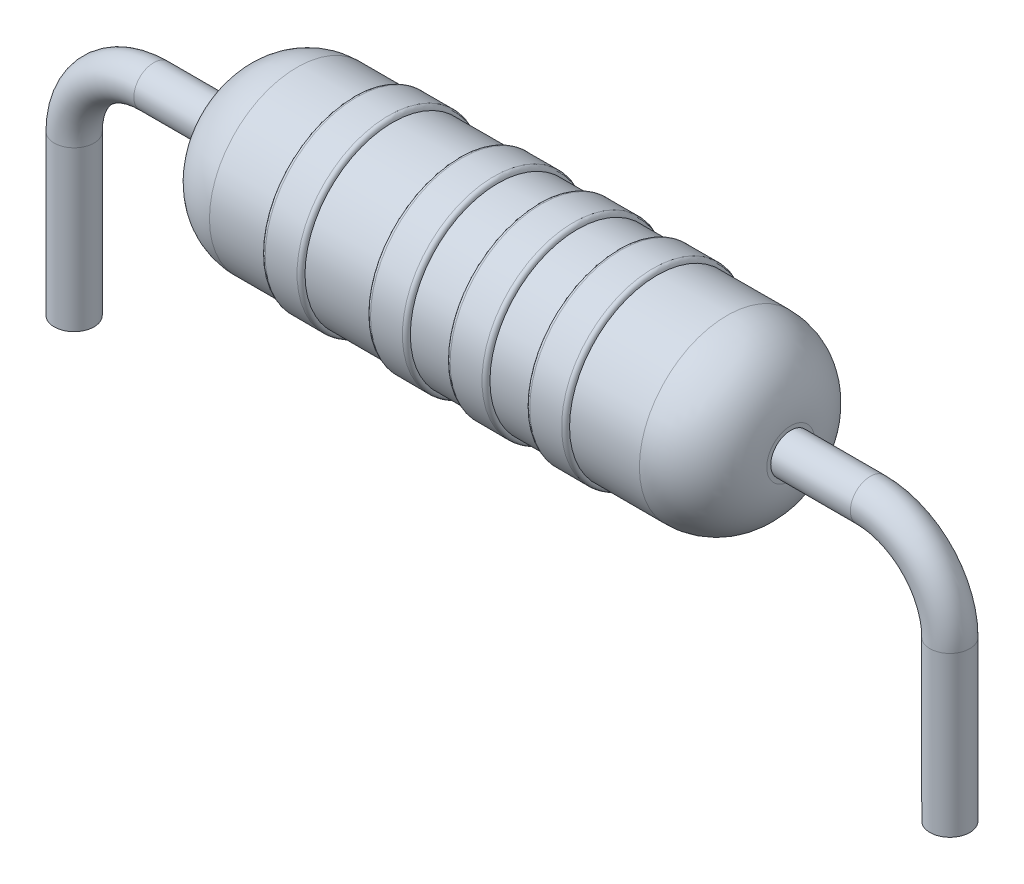
ISO-10303-21;
HEADER;
FILE_DESCRIPTION(('STEP AP214'),'2;1');
FILE_NAME('part.step','',(''),(''),'','','');
FILE_SCHEMA(('AUTOMOTIVE_DESIGN { 1 0 10303 214 1 1 1 1 }'));
ENDSEC;
DATA;
#1=APPLICATION_CONTEXT('core data for automotive mechanical design processes');
#2=APPLICATION_PROTOCOL_DEFINITION('international standard','automotive_design',2000,#1);
#3=PRODUCT_CONTEXT('',#1,'mechanical');
#4=PRODUCT('Part','Part','',(#3));
#5=PRODUCT_RELATED_PRODUCT_CATEGORY('part','',(#4));
#6=PRODUCT_DEFINITION_FORMATION('','',#4);
#7=PRODUCT_DEFINITION_CONTEXT('part definition',#1,'design');
#8=PRODUCT_DEFINITION('design','',#6,#7);
#9=PRODUCT_DEFINITION_SHAPE('','',#8);
#10=(LENGTH_UNIT() NAMED_UNIT(*) SI_UNIT(.MILLI.,.METRE.));
#11=(NAMED_UNIT(*) PLANE_ANGLE_UNIT() SI_UNIT($,.RADIAN.));
#12=(NAMED_UNIT(*) SI_UNIT($,.STERADIAN.) SOLID_ANGLE_UNIT());
#13=UNCERTAINTY_MEASURE_WITH_UNIT(LENGTH_MEASURE(1.E-05),#10,'distance_accuracy_value','');
#14=(GEOMETRIC_REPRESENTATION_CONTEXT(3) GLOBAL_UNCERTAINTY_ASSIGNED_CONTEXT((#13)) GLOBAL_UNIT_ASSIGNED_CONTEXT((#10,
#11,#12)) REPRESENTATION_CONTEXT('',''));
#15=CARTESIAN_POINT('',(0.,0.,0.));
#16=DIRECTION('',(0.,0.,1.));
#17=DIRECTION('',(1.,0.,0.));
#18=AXIS2_PLACEMENT_3D('',#15,#16,#17);
#19=CARTESIAN_POINT('',(-3.5,0.,0.));
#20=DIRECTION('',(1.,0.,0.));
#21=DIRECTION('',(0.,0.,-1.));
#22=AXIS2_PLACEMENT_3D('',#19,#20,#21);
#23=PLANE('',#22);
#24=CARTESIAN_POINT('',(-3.5,0.,0.));
#25=DIRECTION('',(-1.,0.,0.));
#26=DIRECTION('',(0.,0.,1.));
#27=AXIS2_PLACEMENT_3D('',#24,#25,#26);
#28=CIRCLE('',#27,0.299999999999995);
#29=CARTESIAN_POINT('',(-3.5,0.,0.299999999999995));
#30=VERTEX_POINT('',#29);
#31=EDGE_CURVE('E61',#30,#30,#28,.T.);
#32=ORIENTED_EDGE('',*,*,#31,.T.);
#33=EDGE_LOOP('',(#32));
#34=FACE_BOUND('',#33,.T.);
#35=CARTESIAN_POINT('',(-3.5,0.,0.));
#36=DIRECTION('',(-1.,0.,0.));
#37=DIRECTION('',(0.,0.,1.));
#38=AXIS2_PLACEMENT_3D('',#35,#36,#37);
#39=CIRCLE('',#38,0.25);
#40=CARTESIAN_POINT('',(-3.5,0.,0.25));
#41=VERTEX_POINT('',#40);
#42=EDGE_CURVE('E10',#41,#41,#39,.T.);
#43=ORIENTED_EDGE('',*,*,#42,.F.);
#44=EDGE_LOOP('',(#43));
#45=FACE_BOUND('',#44,.T.);
#46=ADVANCED_FACE('F34',(#34,#45),#23,.F.);
#47=CARTESIAN_POINT('',(-54.2686615886834,0.,0.));
#48=DIRECTION('',(-1.,0.,0.));
#49=DIRECTION('',(0.,0.,1.));
#50=AXIS2_PLACEMENT_3D('',#47,#48,#49);
#51=CYLINDRICAL_SURFACE('',#50,1.1);
#52=CARTESIAN_POINT('',(0.322975145638588,0.,0.));
#53=DIRECTION('',(-1.,0.,0.));
#54=DIRECTION('',(0.,0.,1.));
#55=AXIS2_PLACEMENT_3D('',#52,#53,#54);
#56=CIRCLE('',#55,1.1);
#57=CARTESIAN_POINT('',(0.322975145638588,0.,1.1));
#58=VERTEX_POINT('',#57);
#59=EDGE_CURVE('E81',#58,#58,#56,.T.);
#60=ORIENTED_EDGE('',*,*,#59,.T.);
#61=EDGE_LOOP('',(#60));
#62=FACE_BOUND('',#61,.T.);
#63=CARTESIAN_POINT('',(-0.177024854361413,0.,0.));
#64=DIRECTION('',(1.,0.,0.));
#65=DIRECTION('',(0.,0.,-1.));
#66=AXIS2_PLACEMENT_3D('',#63,#64,#65);
#67=CIRCLE('',#66,1.1);
#68=CARTESIAN_POINT('',(-0.177024854361413,0.,-1.1));
#69=VERTEX_POINT('',#68);
#70=EDGE_CURVE('E65',#69,#69,#67,.T.);
#71=ORIENTED_EDGE('',*,*,#70,.T.);
#72=EDGE_LOOP('',(#71));
#73=FACE_BOUND('',#72,.T.);
#74=ADVANCED_FACE('F149',(#62,#73),#51,.T.);
#75=CARTESIAN_POINT('',(4.3261723446646,0.,0.));
#76=DIRECTION('',(1.,0.,0.));
#77=DIRECTION('',(0.,0.,-1.));
#78=AXIS2_PLACEMENT_3D('',#75,#76,#77);
#79=CYLINDRICAL_SURFACE('',#78,1.15);
#80=CARTESIAN_POINT('',(-0.627024854361413,0.,0.));
#81=DIRECTION('',(-1.,0.,0.));
#82=DIRECTION('',(0.,0.,1.));
#83=AXIS2_PLACEMENT_3D('',#80,#81,#82);
#84=CIRCLE('',#83,1.15);
#85=CARTESIAN_POINT('',(-0.627024854361413,0.,1.15));
#86=VERTEX_POINT('',#85);
#87=EDGE_CURVE('E105',#86,#86,#84,.F.);
#88=ORIENTED_EDGE('',*,*,#87,.T.);
#89=EDGE_LOOP('',(#88));
#90=FACE_BOUND('',#89,.T.);
#91=CARTESIAN_POINT('',(-0.227024854361413,0.,0.));
#92=DIRECTION('',(1.,0.,0.));
#93=DIRECTION('',(0.,0.,-1.));
#94=AXIS2_PLACEMENT_3D('',#91,#92,#93);
#95=CIRCLE('',#94,1.15);
#96=CARTESIAN_POINT('',(-0.227024854361413,0.,-1.15));
#97=VERTEX_POINT('',#96);
#98=EDGE_CURVE('E102',#97,#97,#95,.F.);
#99=ORIENTED_EDGE('',*,*,#98,.T.);
#100=EDGE_LOOP('',(#99));
#101=FACE_BOUND('',#100,.T.);
#102=ADVANCED_FACE('F155',(#90,#101),#79,.T.);
#103=CARTESIAN_POINT('',(-1.5,0.,0.));
#104=DIRECTION('',(1.,0.,0.));
#105=DIRECTION('',(0.,0.,-1.));
#106=AXIS2_PLACEMENT_3D('',#103,#104,#105);
#107=CIRCLE('',#106,1.1);
#108=CARTESIAN_POINT('',(-1.5,0.,-1.1));
#109=VERTEX_POINT('',#108);
#110=EDGE_CURVE('E60',#109,#109,#107,.T.);
#111=ORIENTED_EDGE('',*,*,#110,.T.);
#112=EDGE_LOOP('',(#111));
#113=FACE_BOUND('',#112,.T.);
#114=CARTESIAN_POINT('',(-0.677024854361413,0.,0.));
#115=DIRECTION('',(-1.,0.,0.));
#116=DIRECTION('',(0.,0.,1.));
#117=AXIS2_PLACEMENT_3D('',#114,#115,#116);
#118=CIRCLE('',#117,1.1);
#119=CARTESIAN_POINT('',(-0.677024854361413,0.,1.1));
#120=VERTEX_POINT('',#119);
#121=EDGE_CURVE('E75',#120,#120,#118,.T.);
#122=ORIENTED_EDGE('',*,*,#121,.T.);
#123=EDGE_LOOP('',(#122));
#124=FACE_BOUND('',#123,.T.);
#125=ADVANCED_FACE('F157',(#113,#124),#51,.T.);
#126=CARTESIAN_POINT('',(4.3261723446646,0.,0.));
#127=DIRECTION('',(1.,0.,0.));
#128=DIRECTION('',(0.,0.,-1.));
#129=AXIS2_PLACEMENT_3D('',#126,#127,#128);
#130=CYLINDRICAL_SURFACE('',#129,1.15);
#131=CARTESIAN_POINT('',(0.372975145638587,0.,0.));
#132=DIRECTION('',(-1.,0.,0.));
#133=DIRECTION('',(0.,0.,1.));
#134=AXIS2_PLACEMENT_3D('',#131,#132,#133);
#135=CIRCLE('',#134,1.15);
#136=CARTESIAN_POINT('',(0.372975145638587,0.,1.15));
#137=VERTEX_POINT('',#136);
#138=EDGE_CURVE('E111',#137,#137,#135,.F.);
#139=ORIENTED_EDGE('',*,*,#138,.T.);
#140=EDGE_LOOP('',(#139));
#141=FACE_BOUND('',#140,.T.);
#142=CARTESIAN_POINT('',(0.772975145638587,0.,0.));
#143=DIRECTION('',(1.,0.,0.));
#144=DIRECTION('',(0.,0.,-1.));
#145=AXIS2_PLACEMENT_3D('',#142,#143,#144);
#146=CIRCLE('',#145,1.15);
#147=CARTESIAN_POINT('',(0.772975145638587,0.,-1.15));
#148=VERTEX_POINT('',#147);
#149=EDGE_CURVE('E108',#148,#148,#146,.F.);
#150=ORIENTED_EDGE('',*,*,#149,.T.);
#151=EDGE_LOOP('',(#150));
#152=FACE_BOUND('',#151,.T.);
#153=ADVANCED_FACE('F166',(#141,#152),#130,.T.);
#154=CARTESIAN_POINT('',(1.32297514563859,0.,0.));
#155=DIRECTION('',(-1.,0.,0.));
#156=DIRECTION('',(0.,0.,1.));
#157=AXIS2_PLACEMENT_3D('',#154,#155,#156);
#158=CIRCLE('',#157,1.1);
#159=CARTESIAN_POINT('',(1.32297514563859,0.,1.1));
#160=VERTEX_POINT('',#159);
#161=EDGE_CURVE('E87',#160,#160,#158,.T.);
#162=ORIENTED_EDGE('',*,*,#161,.T.);
#163=EDGE_LOOP('',(#162));
#164=FACE_BOUND('',#163,.T.);
#165=CARTESIAN_POINT('',(0.822975145638588,0.,0.));
#166=DIRECTION('',(1.,0.,0.));
#167=DIRECTION('',(0.,0.,-1.));
#168=AXIS2_PLACEMENT_3D('',#165,#166,#167);
#169=CIRCLE('',#168,1.1);
#170=CARTESIAN_POINT('',(0.822975145638588,0.,-1.1));
#171=VERTEX_POINT('',#170);
#172=EDGE_CURVE('E78',#171,#171,#169,.T.);
#173=ORIENTED_EDGE('',*,*,#172,.T.);
#174=EDGE_LOOP('',(#173));
#175=FACE_BOUND('',#174,.T.);
#176=ADVANCED_FACE('F132',(#164,#175),#51,.T.);
#177=CARTESIAN_POINT('',(4.3261723446646,0.,0.));
#178=DIRECTION('',(1.,0.,0.));
#179=DIRECTION('',(0.,0.,-1.));
#180=AXIS2_PLACEMENT_3D('',#177,#178,#179);
#181=CYLINDRICAL_SURFACE('',#180,1.15);
#182=CARTESIAN_POINT('',(1.37297514563859,0.,0.));
#183=DIRECTION('',(-1.,0.,0.));
#184=DIRECTION('',(0.,0.,1.));
#185=AXIS2_PLACEMENT_3D('',#182,#183,#184);
#186=CIRCLE('',#185,1.15);
#187=CARTESIAN_POINT('',(1.37297514563859,0.,1.15));
#188=VERTEX_POINT('',#187);
#189=EDGE_CURVE('E38',#188,#188,#186,.F.);
#190=ORIENTED_EDGE('',*,*,#189,.T.);
#191=EDGE_LOOP('',(#190));
#192=FACE_BOUND('',#191,.T.);
#193=CARTESIAN_POINT('',(1.77297514563859,0.,0.));
#194=DIRECTION('',(1.,0.,0.));
#195=DIRECTION('',(0.,0.,-1.));
#196=AXIS2_PLACEMENT_3D('',#193,#194,#195);
#197=CIRCLE('',#196,1.15);
#198=CARTESIAN_POINT('',(1.77297514563859,0.,-1.15));
#199=VERTEX_POINT('',#198);
#200=EDGE_CURVE('E46',#199,#199,#197,.F.);
#201=ORIENTED_EDGE('',*,*,#200,.T.);
#202=EDGE_LOOP('',(#201));
#203=FACE_BOUND('',#202,.T.);
#204=ADVANCED_FACE('F116',(#192,#203),#181,.T.);
#205=CARTESIAN_POINT('',(3.5,0.299999999999995,0.));
#206=DIRECTION('',(-1.,0.,0.));
#207=DIRECTION('',(0.,0.,1.));
#208=AXIS2_PLACEMENT_3D('',#205,#206,#207);
#209=PLANE('',#208);
#210=CARTESIAN_POINT('',(3.5,0.,0.));
#211=DIRECTION('',(-1.,0.,0.));
#212=DIRECTION('',(0.,0.,1.));
#213=AXIS2_PLACEMENT_3D('',#210,#211,#212);
#214=CIRCLE('',#213,0.25);
#215=CARTESIAN_POINT('',(3.5,0.,0.25));
#216=VERTEX_POINT('',#215);
#217=EDGE_CURVE('E263',#216,#216,#214,.T.);
#218=ORIENTED_EDGE('',*,*,#217,.T.);
#219=EDGE_LOOP('',(#218));
#220=FACE_BOUND('',#219,.T.);
#221=CARTESIAN_POINT('',(3.5,0.,0.));
#222=DIRECTION('',(-1.,0.,0.));
#223=DIRECTION('',(0.,0.,1.));
#224=AXIS2_PLACEMENT_3D('',#221,#222,#223);
#225=CIRCLE('',#224,0.299999999999995);
#226=CARTESIAN_POINT('',(3.5,0.,0.299999999999995));
#227=VERTEX_POINT('',#226);
#228=EDGE_CURVE('E71',#227,#227,#225,.T.);
#229=ORIENTED_EDGE('',*,*,#228,.F.);
#230=EDGE_LOOP('',(#229));
#231=FACE_BOUND('',#230,.T.);
#232=ADVANCED_FACE('F36',(#220,#231),#209,.F.);
#233=CARTESIAN_POINT('',(2.7,0.,0.));
#234=DIRECTION('',(-1.,0.,0.));
#235=DIRECTION('',(0.,0.,1.));
#236=AXIS2_PLACEMENT_3D('',#233,#234,#235);
#237=DEGENERATE_TOROIDAL_SURFACE('',#236,0.3,0.8,.T.);
#238=CARTESIAN_POINT('',(2.69999999999999,0.,0.));
#239=DIRECTION('',(-1.,0.,0.));
#240=DIRECTION('',(0.,0.,1.));
#241=AXIS2_PLACEMENT_3D('',#238,#239,#240);
#242=CIRCLE('',#241,1.1);
#243=CARTESIAN_POINT('',(2.69999999999999,0.,1.1));
#244=VERTEX_POINT('',#243);
#245=EDGE_CURVE('E68',#244,#244,#242,.T.);
#246=ORIENTED_EDGE('',*,*,#245,.F.);
#247=EDGE_LOOP('',(#246));
#248=FACE_BOUND('',#247,.T.);
#249=ORIENTED_EDGE('',*,*,#228,.T.);
#250=EDGE_LOOP('',(#249));
#251=FACE_BOUND('',#250,.T.);
#252=ADVANCED_FACE('F130',(#248,#251),#237,.T.);
#253=CARTESIAN_POINT('',(1.82297514563859,0.,0.));
#254=DIRECTION('',(1.,0.,0.));
#255=DIRECTION('',(0.,0.,-1.));
#256=AXIS2_PLACEMENT_3D('',#253,#254,#255);
#257=CIRCLE('',#256,1.1);
#258=CARTESIAN_POINT('',(1.82297514563859,0.,-1.1));
#259=VERTEX_POINT('',#258);
#260=EDGE_CURVE('E84',#259,#259,#257,.T.);
#261=ORIENTED_EDGE('',*,*,#260,.T.);
#262=EDGE_LOOP('',(#261));
#263=FACE_BOUND('',#262,.T.);
#264=ORIENTED_EDGE('',*,*,#245,.T.);
#265=EDGE_LOOP('',(#264));
#266=FACE_BOUND('',#265,.T.);
#267=ADVANCED_FACE('F126',(#263,#266),#51,.T.);
#268=CARTESIAN_POINT('',(4.3261723446646,0.,0.));
#269=DIRECTION('',(1.,0.,0.));
#270=DIRECTION('',(0.,0.,-1.));
#271=AXIS2_PLACEMENT_3D('',#268,#269,#270);
#272=CYLINDRICAL_SURFACE('',#271,1.15);
#273=CARTESIAN_POINT('',(-1.95,0.,0.));
#274=DIRECTION('',(-1.,0.,0.));
#275=DIRECTION('',(0.,0.,1.));
#276=AXIS2_PLACEMENT_3D('',#273,#274,#275);
#277=CIRCLE('',#276,1.15);
#278=CARTESIAN_POINT('',(-1.95,0.,1.15));
#279=VERTEX_POINT('',#278);
#280=EDGE_CURVE('E99',#279,#279,#277,.F.);
#281=ORIENTED_EDGE('',*,*,#280,.T.);
#282=EDGE_LOOP('',(#281));
#283=FACE_BOUND('',#282,.T.);
#284=CARTESIAN_POINT('',(-1.55,0.,0.));
#285=DIRECTION('',(1.,0.,0.));
#286=DIRECTION('',(0.,0.,-1.));
#287=AXIS2_PLACEMENT_3D('',#284,#285,#286);
#288=CIRCLE('',#287,1.15);
#289=CARTESIAN_POINT('',(-1.55,0.,-1.15));
#290=VERTEX_POINT('',#289);
#291=EDGE_CURVE('E74',#290,#290,#288,.F.);
#292=ORIENTED_EDGE('',*,*,#291,.T.);
#293=EDGE_LOOP('',(#292));
#294=FACE_BOUND('',#293,.T.);
#295=ADVANCED_FACE('F129',(#283,#294),#272,.T.);
#296=CARTESIAN_POINT('',(-2.7,0.,0.));
#297=DIRECTION('',(-1.,0.,0.));
#298=DIRECTION('',(0.,0.,1.));
#299=AXIS2_PLACEMENT_3D('',#296,#297,#298);
#300=DEGENERATE_TOROIDAL_SURFACE('',#299,0.3,0.8,.T.);
#301=ORIENTED_EDGE('',*,*,#31,.F.);
#302=EDGE_LOOP('',(#301));
#303=FACE_BOUND('',#302,.T.);
#304=CARTESIAN_POINT('',(-2.69999999999999,0.,0.));
#305=DIRECTION('',(-1.,0.,0.));
#306=DIRECTION('',(0.,0.,1.));
#307=AXIS2_PLACEMENT_3D('',#304,#305,#306);
#308=CIRCLE('',#307,1.1);
#309=CARTESIAN_POINT('',(-2.69999999999999,0.,1.1));
#310=VERTEX_POINT('',#309);
#311=EDGE_CURVE('E64',#310,#310,#308,.T.);
#312=ORIENTED_EDGE('',*,*,#311,.T.);
#313=EDGE_LOOP('',(#312));
#314=FACE_BOUND('',#313,.T.);
#315=ADVANCED_FACE('F162',(#303,#314),#300,.T.);
#316=CARTESIAN_POINT('',(-2.,0.,0.));
#317=DIRECTION('',(-1.,0.,0.));
#318=DIRECTION('',(0.,0.,1.));
#319=AXIS2_PLACEMENT_3D('',#316,#317,#318);
#320=CIRCLE('',#319,1.1);
#321=CARTESIAN_POINT('',(-2.,0.,1.1));
#322=VERTEX_POINT('',#321);
#323=EDGE_CURVE('E90',#322,#322,#320,.T.);
#324=ORIENTED_EDGE('',*,*,#323,.T.);
#325=EDGE_LOOP('',(#324));
#326=FACE_BOUND('',#325,.T.);
#327=ORIENTED_EDGE('',*,*,#311,.F.);
#328=EDGE_LOOP('',(#327));
#329=FACE_BOUND('',#328,.T.);
#330=ADVANCED_FACE('F133',(#326,#329),#51,.T.);
#331=CARTESIAN_POINT('',(-1.95,0.,0.));
#332=DIRECTION('',(-1.,0.,0.));
#333=DIRECTION('',(0.,0.,1.));
#334=AXIS2_PLACEMENT_3D('',#331,#332,#333);
#335=TOROIDAL_SURFACE('',#334,1.1,0.05);
#336=ORIENTED_EDGE('',*,*,#323,.F.);
#337=EDGE_LOOP('',(#336));
#338=FACE_BOUND('',#337,.T.);
#339=ORIENTED_EDGE('',*,*,#280,.F.);
#340=EDGE_LOOP('',(#339));
#341=FACE_BOUND('',#340,.T.);
#342=ADVANCED_FACE('F176',(#338,#341),#335,.T.);
#343=CARTESIAN_POINT('',(-1.55,0.,0.));
#344=DIRECTION('',(1.,0.,0.));
#345=DIRECTION('',(0.,0.,-1.));
#346=AXIS2_PLACEMENT_3D('',#343,#344,#345);
#347=TOROIDAL_SURFACE('',#346,1.1,0.05);
#348=ORIENTED_EDGE('',*,*,#291,.F.);
#349=EDGE_LOOP('',(#348));
#350=FACE_BOUND('',#349,.T.);
#351=ORIENTED_EDGE('',*,*,#110,.F.);
#352=EDGE_LOOP('',(#351));
#353=FACE_BOUND('',#352,.T.);
#354=ADVANCED_FACE('F181',(#350,#353),#347,.T.);
#355=CARTESIAN_POINT('',(-0.627024854361413,0.,0.));
#356=DIRECTION('',(-1.,0.,0.));
#357=DIRECTION('',(0.,0.,1.));
#358=AXIS2_PLACEMENT_3D('',#355,#356,#357);
#359=TOROIDAL_SURFACE('',#358,1.1,0.05);
#360=ORIENTED_EDGE('',*,*,#121,.F.);
#361=EDGE_LOOP('',(#360));
#362=FACE_BOUND('',#361,.T.);
#363=ORIENTED_EDGE('',*,*,#87,.F.);
#364=EDGE_LOOP('',(#363));
#365=FACE_BOUND('',#364,.T.);
#366=ADVANCED_FACE('F198',(#362,#365),#359,.T.);
#367=CARTESIAN_POINT('',(-0.227024854361413,0.,0.));
#368=DIRECTION('',(1.,0.,0.));
#369=DIRECTION('',(0.,0.,-1.));
#370=AXIS2_PLACEMENT_3D('',#367,#368,#369);
#371=TOROIDAL_SURFACE('',#370,1.1,0.05);
#372=ORIENTED_EDGE('',*,*,#98,.F.);
#373=EDGE_LOOP('',(#372));
#374=FACE_BOUND('',#373,.T.);
#375=ORIENTED_EDGE('',*,*,#70,.F.);
#376=EDGE_LOOP('',(#375));
#377=FACE_BOUND('',#376,.T.);
#378=ADVANCED_FACE('F204',(#374,#377),#371,.T.);
#379=CARTESIAN_POINT('',(0.372975145638587,0.,0.));
#380=DIRECTION('',(-1.,0.,0.));
#381=DIRECTION('',(0.,0.,1.));
#382=AXIS2_PLACEMENT_3D('',#379,#380,#381);
#383=TOROIDAL_SURFACE('',#382,1.1,0.05);
#384=ORIENTED_EDGE('',*,*,#59,.F.);
#385=EDGE_LOOP('',(#384));
#386=FACE_BOUND('',#385,.T.);
#387=ORIENTED_EDGE('',*,*,#138,.F.);
#388=EDGE_LOOP('',(#387));
#389=FACE_BOUND('',#388,.T.);
#390=ADVANCED_FACE('F210',(#386,#389),#383,.T.);
#391=CARTESIAN_POINT('',(0.772975145638587,0.,0.));
#392=DIRECTION('',(1.,0.,0.));
#393=DIRECTION('',(0.,0.,-1.));
#394=AXIS2_PLACEMENT_3D('',#391,#392,#393);
#395=TOROIDAL_SURFACE('',#394,1.1,0.05);
#396=ORIENTED_EDGE('',*,*,#149,.F.);
#397=EDGE_LOOP('',(#396));
#398=FACE_BOUND('',#397,.T.);
#399=ORIENTED_EDGE('',*,*,#172,.F.);
#400=EDGE_LOOP('',(#399));
#401=FACE_BOUND('',#400,.T.);
#402=ADVANCED_FACE('F214',(#398,#401),#395,.T.);
#403=CARTESIAN_POINT('',(1.37297514563859,0.,0.));
#404=DIRECTION('',(-1.,0.,0.));
#405=DIRECTION('',(0.,0.,1.));
#406=AXIS2_PLACEMENT_3D('',#403,#404,#405);
#407=TOROIDAL_SURFACE('',#406,1.1,0.05);
#408=ORIENTED_EDGE('',*,*,#161,.F.);
#409=EDGE_LOOP('',(#408));
#410=FACE_BOUND('',#409,.T.);
#411=ORIENTED_EDGE('',*,*,#189,.F.);
#412=EDGE_LOOP('',(#411));
#413=FACE_BOUND('',#412,.T.);
#414=ADVANCED_FACE('F122',(#410,#413),#407,.T.);
#415=CARTESIAN_POINT('',(1.77297514563859,0.,0.));
#416=DIRECTION('',(1.,0.,0.));
#417=DIRECTION('',(0.,0.,-1.));
#418=AXIS2_PLACEMENT_3D('',#415,#416,#417);
#419=TOROIDAL_SURFACE('',#418,1.1,0.05);
#420=ORIENTED_EDGE('',*,*,#200,.F.);
#421=EDGE_LOOP('',(#420));
#422=FACE_BOUND('',#421,.T.);
#423=ORIENTED_EDGE('',*,*,#260,.F.);
#424=EDGE_LOOP('',(#423));
#425=FACE_BOUND('',#424,.T.);
#426=ADVANCED_FACE('F118',(#422,#425),#419,.T.);
#427=CARTESIAN_POINT('',(-5.5,-1.00000000000001,0.));
#428=DIRECTION('',(0.,-1.,0.));
#429=DIRECTION('',(0.,0.,-1.));
#430=AXIS2_PLACEMENT_3D('',#427,#428,#429);
#431=CYLINDRICAL_SURFACE('',#430,0.25);
#432=CARTESIAN_POINT('',(-5.5,-1.00000000000001,0.));
#433=DIRECTION('',(0.,-1.,0.));
#434=DIRECTION('',(0.,0.,1.));
#435=AXIS2_PLACEMENT_3D('',#432,#433,#434);
#436=CIRCLE('',#435,0.25);
#437=CARTESIAN_POINT('',(-5.75,-1.00000000000001,0.));
#438=VERTEX_POINT('',#437);
#439=EDGE_CURVE('E54',#438,#438,#436,.T.);
#440=ORIENTED_EDGE('',*,*,#439,.T.);
#441=EDGE_LOOP('',(#440));
#442=FACE_BOUND('',#441,.T.);
#443=CARTESIAN_POINT('',(-5.5,-3.,0.));
#444=DIRECTION('',(0.,-1.,0.));
#445=DIRECTION('',(0.,0.,1.));
#446=AXIS2_PLACEMENT_3D('',#443,#444,#445);
#447=CIRCLE('',#446,0.25);
#448=CARTESIAN_POINT('',(-5.5,-3.,0.25));
#449=VERTEX_POINT('',#448);
#450=EDGE_CURVE('E57',#449,#449,#447,.T.);
#451=ORIENTED_EDGE('',*,*,#450,.F.);
#452=EDGE_LOOP('',(#451));
#453=FACE_BOUND('',#452,.T.);
#454=ADVANCED_FACE('F121',(#442,#453),#431,.T.);
#455=CARTESIAN_POINT('',(-4.5,-1.,0.));
#456=DIRECTION('',(0.,0.,1.));
#457=DIRECTION('',(1.,0.,0.));
#458=AXIS2_PLACEMENT_3D('',#455,#456,#457);
#459=TOROIDAL_SURFACE('',#458,1.,0.25);
#460=CARTESIAN_POINT('',(-4.49999999999999,0.,0.));
#461=DIRECTION('',(-1.,0.,0.));
#462=DIRECTION('',(0.,0.,1.));
#463=AXIS2_PLACEMENT_3D('',#460,#461,#462);
#464=CIRCLE('',#463,0.25);
#465=CARTESIAN_POINT('',(-4.49999999999999,0.25,0.));
#466=VERTEX_POINT('',#465);
#467=EDGE_CURVE('E51',#466,#466,#464,.T.);
#468=CARTESIAN_POINT('',(-4.5,-1.,0.));
#469=DIRECTION('',(0.,0.,1.));
#470=DIRECTION('',(1.,0.,0.));
#471=AXIS2_PLACEMENT_3D('',#468,#469,#470);
#472=CIRCLE('',#471,1.25);
#473=EDGE_CURVE('',#466,#438,#472,.T.);
#474=ORIENTED_EDGE('',*,*,#467,.T.);
#475=ORIENTED_EDGE('',*,*,#439,.F.);
#476=ORIENTED_EDGE('',*,*,#473,.T.);
#477=ORIENTED_EDGE('',*,*,#473,.F.);
#478=EDGE_LOOP('',(#474,#476,#475,#477));
#479=FACE_BOUND('',#478,.T.);
#480=ADVANCED_FACE('F224',(#479),#459,.T.);
#481=CARTESIAN_POINT('',(-4.49999999999999,0.,0.));
#482=DIRECTION('',(1.,0.,0.));
#483=DIRECTION('',(0.,0.,-1.));
#484=AXIS2_PLACEMENT_3D('',#481,#482,#483);
#485=CYLINDRICAL_SURFACE('',#484,0.25);
#486=ORIENTED_EDGE('',*,*,#467,.F.);
#487=EDGE_LOOP('',(#486));
#488=FACE_BOUND('',#487,.T.);
#489=ORIENTED_EDGE('',*,*,#42,.T.);
#490=EDGE_LOOP('',(#489));
#491=FACE_BOUND('',#490,.T.);
#492=ADVANCED_FACE('F228',(#488,#491),#485,.T.);
#493=CARTESIAN_POINT('',(-5.5,-3.,0.));
#494=DIRECTION('',(0.,-1.,0.));
#495=DIRECTION('',(0.,0.,1.));
#496=AXIS2_PLACEMENT_3D('',#493,#494,#495);
#497=PLANE('',#496);
#498=ORIENTED_EDGE('',*,*,#450,.T.);
#499=EDGE_LOOP('',(#498));
#500=FACE_BOUND('',#499,.T.);
#501=ADVANCED_FACE('F232',(#500),#497,.T.);
#502=CARTESIAN_POINT('',(5.5,-1.00000000000001,0.));
#503=DIRECTION('',(0.,-1.,0.));
#504=DIRECTION('',(0.,0.,-1.));
#505=AXIS2_PLACEMENT_3D('',#502,#503,#504);
#506=CYLINDRICAL_SURFACE('',#505,0.25);
#507=CARTESIAN_POINT('',(5.5,-1.00000000000001,0.));
#508=DIRECTION('',(0.,1.,0.));
#509=DIRECTION('',(0.,0.,1.));
#510=AXIS2_PLACEMENT_3D('',#507,#508,#509);
#511=CIRCLE('',#510,0.25);
#512=CARTESIAN_POINT('',(5.75,-1.00000000000001,0.));
#513=VERTEX_POINT('',#512);
#514=EDGE_CURVE('E257',#513,#513,#511,.T.);
#515=ORIENTED_EDGE('',*,*,#514,.F.);
#516=EDGE_LOOP('',(#515));
#517=FACE_BOUND('',#516,.T.);
#518=CARTESIAN_POINT('',(5.5,-3.,0.));
#519=DIRECTION('',(0.,1.,0.));
#520=DIRECTION('',(0.,0.,1.));
#521=AXIS2_PLACEMENT_3D('',#518,#519,#520);
#522=CIRCLE('',#521,0.25);
#523=CARTESIAN_POINT('',(5.5,-3.,0.25));
#524=VERTEX_POINT('',#523);
#525=EDGE_CURVE('E49',#524,#524,#522,.T.);
#526=ORIENTED_EDGE('',*,*,#525,.T.);
#527=EDGE_LOOP('',(#526));
#528=FACE_BOUND('',#527,.T.);
#529=ADVANCED_FACE('F236',(#517,#528),#506,.T.);
#530=CARTESIAN_POINT('',(4.5,-1.,0.));
#531=DIRECTION('',(0.,0.,-1.));
#532=DIRECTION('',(-1.,0.,0.));
#533=AXIS2_PLACEMENT_3D('',#530,#531,#532);
#534=TOROIDAL_SURFACE('',#533,1.,0.25);
#535=CARTESIAN_POINT('',(4.49999999999999,0.,0.));
#536=DIRECTION('',(-1.,0.,0.));
#537=DIRECTION('',(0.,0.,1.));
#538=AXIS2_PLACEMENT_3D('',#535,#536,#537);
#539=CIRCLE('',#538,0.25);
#540=CARTESIAN_POINT('',(4.49999999999999,0.25,0.));
#541=VERTEX_POINT('',#540);
#542=EDGE_CURVE('E259',#541,#541,#539,.T.);
#543=CARTESIAN_POINT('',(4.5,-1.,0.));
#544=DIRECTION('',(0.,0.,-1.));
#545=DIRECTION('',(-1.,0.,0.));
#546=AXIS2_PLACEMENT_3D('',#543,#544,#545);
#547=CIRCLE('',#546,1.25);
#548=EDGE_CURVE('',#541,#513,#547,.T.);
#549=ORIENTED_EDGE('',*,*,#542,.F.);
#550=ORIENTED_EDGE('',*,*,#514,.T.);
#551=ORIENTED_EDGE('',*,*,#548,.T.);
#552=ORIENTED_EDGE('',*,*,#548,.F.);
#553=EDGE_LOOP('',(#549,#551,#550,#552));
#554=FACE_BOUND('',#553,.T.);
#555=ADVANCED_FACE('F240',(#554),#534,.T.);
#556=CARTESIAN_POINT('',(4.49999999999999,0.,0.));
#557=DIRECTION('',(-1.,0.,0.));
#558=DIRECTION('',(0.,0.,1.));
#559=AXIS2_PLACEMENT_3D('',#556,#557,#558);
#560=CYLINDRICAL_SURFACE('',#559,0.25);
#561=ORIENTED_EDGE('',*,*,#542,.T.);
#562=EDGE_LOOP('',(#561));
#563=FACE_BOUND('',#562,.T.);
#564=ORIENTED_EDGE('',*,*,#217,.F.);
#565=EDGE_LOOP('',(#564));
#566=FACE_BOUND('',#565,.T.);
#567=ADVANCED_FACE('F244',(#563,#566),#560,.T.);
#568=CARTESIAN_POINT('',(5.5,-3.,0.));
#569=DIRECTION('',(0.,-1.,0.));
#570=DIRECTION('',(0.,0.,1.));
#571=AXIS2_PLACEMENT_3D('',#568,#569,#570);
#572=PLANE('',#571);
#573=ORIENTED_EDGE('',*,*,#525,.F.);
#574=EDGE_LOOP('',(#573));
#575=FACE_BOUND('',#574,.T.);
#576=ADVANCED_FACE('F248',(#575),#572,.T.);
#577=CLOSED_SHELL('',(#46,#74,#102,#125,#153,#176,#204,#232,#252,#267,#295,#315,#330,#342,#354,
#366,#378,#390,#402,#414,#426,#454,#480,#492,#501,#529,#555,#567,#576));
#578=MANIFOLD_SOLID_BREP('B2',#577);
#579=ADVANCED_BREP_SHAPE_REPRESENTATION('',(#18,#578),#14);
#580=SHAPE_DEFINITION_REPRESENTATION(#9,#579);
ENDSEC;
END-ISO-10303-21;
